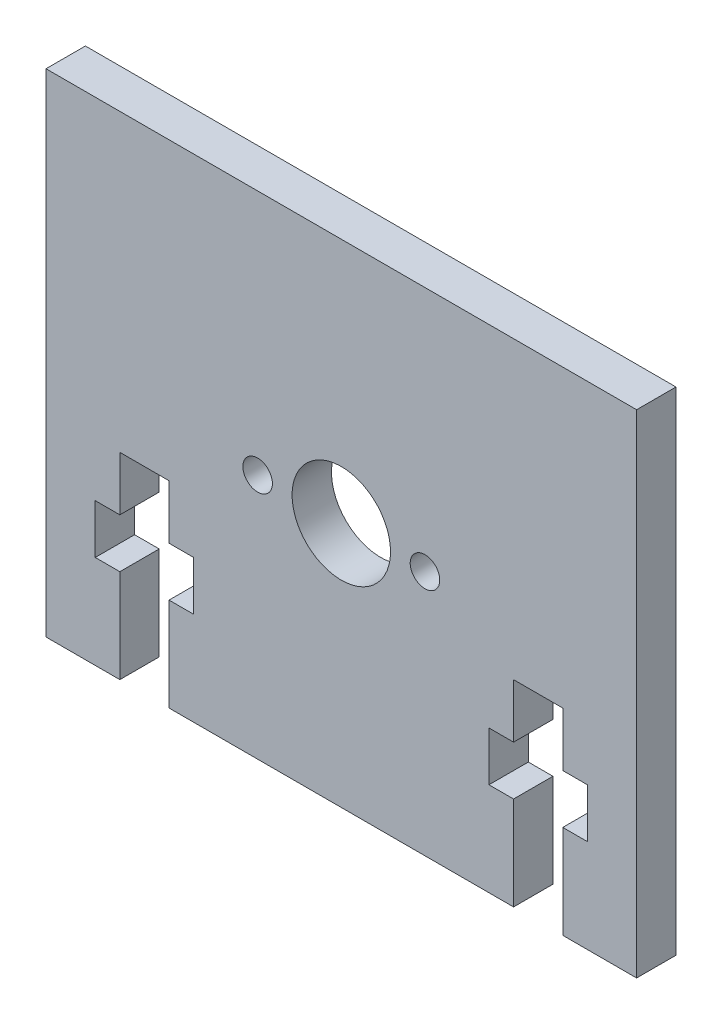
ISO-10303-21;
HEADER;
FILE_DESCRIPTION(('STEP AP214'),'2;1');
FILE_NAME('part.step','',(''),(''),'','','');
FILE_SCHEMA(('AUTOMOTIVE_DESIGN { 1 0 10303 214 1 1 1 1 }'));
ENDSEC;
DATA;
#1=APPLICATION_CONTEXT('core data for automotive mechanical design processes');
#2=APPLICATION_PROTOCOL_DEFINITION('international standard','automotive_design',2000,#1);
#3=PRODUCT_CONTEXT('',#1,'mechanical');
#4=PRODUCT('Part','Part','',(#3));
#5=PRODUCT_RELATED_PRODUCT_CATEGORY('part','',(#4));
#6=PRODUCT_DEFINITION_FORMATION('','',#4);
#7=PRODUCT_DEFINITION_CONTEXT('part definition',#1,'design');
#8=PRODUCT_DEFINITION('design','',#6,#7);
#9=PRODUCT_DEFINITION_SHAPE('','',#8);
#10=(LENGTH_UNIT() NAMED_UNIT(*) SI_UNIT(.MILLI.,.METRE.));
#11=(NAMED_UNIT(*) PLANE_ANGLE_UNIT() SI_UNIT($,.RADIAN.));
#12=(NAMED_UNIT(*) SI_UNIT($,.STERADIAN.) SOLID_ANGLE_UNIT());
#13=UNCERTAINTY_MEASURE_WITH_UNIT(LENGTH_MEASURE(1.E-05),#10,'distance_accuracy_value','');
#14=(GEOMETRIC_REPRESENTATION_CONTEXT(3) GLOBAL_UNCERTAINTY_ASSIGNED_CONTEXT((#13)) GLOBAL_UNIT_ASSIGNED_CONTEXT((#10,
#11,#12)) REPRESENTATION_CONTEXT('',''));
#15=CARTESIAN_POINT('',(0.,0.,0.));
#16=DIRECTION('',(0.,0.,1.));
#17=DIRECTION('',(1.,0.,0.));
#18=AXIS2_PLACEMENT_3D('',#15,#16,#17);
#19=CARTESIAN_POINT('',(30.,-25.,4.));
#20=DIRECTION('',(0.,1.,0.));
#21=DIRECTION('',(-1.,0.,0.));
#22=AXIS2_PLACEMENT_3D('',#19,#20,#21);
#23=PLANE('',#22);
#24=DIRECTION('',(1.,0.,0.));
#25=VECTOR('',#24,1.);
#26=CARTESIAN_POINT('',(30.,-25.,0.));
#27=LINE('',#26,#25);
#28=CARTESIAN_POINT('',(-17.5,-25.,0.));
#29=VERTEX_POINT('',#28);
#30=CARTESIAN_POINT('',(17.5,-25.,0.));
#31=VERTEX_POINT('',#30);
#32=EDGE_CURVE('E237',#29,#31,#27,.T.);
#33=ORIENTED_EDGE('',*,*,#32,.T.);
#34=DIRECTION('',(0.,0.,1.));
#35=VECTOR('',#34,1.);
#36=CARTESIAN_POINT('',(17.5,-25.,0.));
#37=LINE('',#36,#35);
#38=CARTESIAN_POINT('',(17.5,-25.,4.));
#39=VERTEX_POINT('',#38);
#40=EDGE_CURVE('E219',#31,#39,#37,.T.);
#41=ORIENTED_EDGE('',*,*,#40,.T.);
#42=DIRECTION('',(1.,0.,0.));
#43=VECTOR('',#42,1.);
#44=CARTESIAN_POINT('',(30.,-25.,4.));
#45=LINE('',#44,#43);
#46=CARTESIAN_POINT('',(-17.5,-25.,4.));
#47=VERTEX_POINT('',#46);
#48=EDGE_CURVE('E288',#47,#39,#45,.T.);
#49=ORIENTED_EDGE('',*,*,#48,.F.);
#50=DIRECTION('',(0.,0.,1.));
#51=VECTOR('',#50,1.);
#52=CARTESIAN_POINT('',(-17.5,-25.,0.));
#53=LINE('',#52,#51);
#54=EDGE_CURVE('E242',#29,#47,#53,.T.);
#55=ORIENTED_EDGE('',*,*,#54,.F.);
#56=EDGE_LOOP('',(#33,#41,#49,#55));
#57=FACE_BOUND('',#56,.T.);
#58=ADVANCED_FACE('F34',(#57),#23,.F.);
#59=CARTESIAN_POINT('',(-30.,-25.,0.));
#60=VERTEX_POINT('',#59);
#61=CARTESIAN_POINT('',(-22.5,-25.,0.));
#62=VERTEX_POINT('',#61);
#63=EDGE_CURVE('E243',#60,#62,#27,.T.);
#64=ORIENTED_EDGE('',*,*,#63,.T.);
#65=DIRECTION('',(0.,0.,1.));
#66=VECTOR('',#65,1.);
#67=CARTESIAN_POINT('',(-22.5,-25.,0.));
#68=LINE('',#67,#66);
#69=CARTESIAN_POINT('',(-22.5,-25.,4.));
#70=VERTEX_POINT('',#69);
#71=EDGE_CURVE('E340',#62,#70,#68,.T.);
#72=ORIENTED_EDGE('',*,*,#71,.T.);
#73=CARTESIAN_POINT('',(-30.,-25.,4.));
#74=VERTEX_POINT('',#73);
#75=EDGE_CURVE('E290',#74,#70,#45,.T.);
#76=ORIENTED_EDGE('',*,*,#75,.F.);
#77=DIRECTION('',(0.,0.,-1.));
#78=VECTOR('',#77,1.);
#79=CARTESIAN_POINT('',(-30.,-25.,4.));
#80=LINE('',#79,#78);
#81=EDGE_CURVE('E11',#74,#60,#80,.T.);
#82=ORIENTED_EDGE('',*,*,#81,.T.);
#83=EDGE_LOOP('',(#64,#72,#76,#82));
#84=FACE_BOUND('',#83,.T.);
#85=ADVANCED_FACE('F430',(#84),#23,.F.);
#86=CARTESIAN_POINT('',(0.,0.,4.));
#87=DIRECTION('',(0.,0.,-1.));
#88=DIRECTION('',(-1.,0.,0.));
#89=AXIS2_PLACEMENT_3D('',#86,#87,#88);
#90=PLANE('',#89);
#91=ORIENTED_EDGE('',*,*,#48,.T.);
#92=DIRECTION('',(0.,-1.,0.));
#93=VECTOR('',#92,1.);
#94=CARTESIAN_POINT('',(17.5,-15.5,4.));
#95=LINE('',#94,#93);
#96=CARTESIAN_POINT('',(17.5,-15.5,4.));
#97=VERTEX_POINT('',#96);
#98=EDGE_CURVE('E225',#97,#39,#95,.T.);
#99=ORIENTED_EDGE('',*,*,#98,.F.);
#100=DIRECTION('',(1.,0.,0.));
#101=VECTOR('',#100,1.);
#102=CARTESIAN_POINT('',(17.5,-15.5,4.));
#103=LINE('',#102,#101);
#104=CARTESIAN_POINT('',(15.,-15.5,4.));
#105=VERTEX_POINT('',#104);
#106=EDGE_CURVE('E240',#105,#97,#103,.T.);
#107=ORIENTED_EDGE('',*,*,#106,.F.);
#108=DIRECTION('',(0.,-1.,0.));
#109=VECTOR('',#108,1.);
#110=CARTESIAN_POINT('',(15.,-15.5,4.));
#111=LINE('',#110,#109);
#112=CARTESIAN_POINT('',(15.,-10.5,4.));
#113=VERTEX_POINT('',#112);
#114=EDGE_CURVE('E790',#113,#105,#111,.T.);
#115=ORIENTED_EDGE('',*,*,#114,.F.);
#116=DIRECTION('',(-1.,0.,0.));
#117=VECTOR('',#116,1.);
#118=CARTESIAN_POINT('',(17.5,-10.5,4.));
#119=LINE('',#118,#117);
#120=CARTESIAN_POINT('',(17.5,-10.5,4.));
#121=VERTEX_POINT('',#120);
#122=EDGE_CURVE('E816',#121,#113,#119,.T.);
#123=ORIENTED_EDGE('',*,*,#122,.F.);
#124=DIRECTION('',(0.,-1.,0.));
#125=VECTOR('',#124,1.);
#126=CARTESIAN_POINT('',(17.5,-4.99999999999995,4.));
#127=LINE('',#126,#125);
#128=CARTESIAN_POINT('',(17.5,-4.99999999999995,4.));
#129=VERTEX_POINT('',#128);
#130=EDGE_CURVE('E813',#129,#121,#127,.T.);
#131=ORIENTED_EDGE('',*,*,#130,.F.);
#132=DIRECTION('',(-1.,0.,0.));
#133=VECTOR('',#132,1.);
#134=CARTESIAN_POINT('',(22.5,-4.99999999999995,4.));
#135=LINE('',#134,#133);
#136=CARTESIAN_POINT('',(22.5,-4.99999999999995,4.));
#137=VERTEX_POINT('',#136);
#138=EDGE_CURVE('E810',#137,#129,#135,.T.);
#139=ORIENTED_EDGE('',*,*,#138,.F.);
#140=DIRECTION('',(0.,1.,0.));
#141=VECTOR('',#140,1.);
#142=CARTESIAN_POINT('',(22.5,-4.99999999999995,4.));
#143=LINE('',#142,#141);
#144=CARTESIAN_POINT('',(22.5,-10.5,4.));
#145=VERTEX_POINT('',#144);
#146=EDGE_CURVE('E807',#145,#137,#143,.T.);
#147=ORIENTED_EDGE('',*,*,#146,.F.);
#148=DIRECTION('',(-1.,0.,0.));
#149=VECTOR('',#148,1.);
#150=CARTESIAN_POINT('',(25.,-10.5,4.));
#151=LINE('',#150,#149);
#152=CARTESIAN_POINT('',(25.,-10.5,4.));
#153=VERTEX_POINT('',#152);
#154=EDGE_CURVE('E804',#153,#145,#151,.T.);
#155=ORIENTED_EDGE('',*,*,#154,.F.);
#156=DIRECTION('',(0.,1.,0.));
#157=VECTOR('',#156,1.);
#158=CARTESIAN_POINT('',(25.,-15.5,4.));
#159=LINE('',#158,#157);
#160=CARTESIAN_POINT('',(25.,-15.5,4.));
#161=VERTEX_POINT('',#160);
#162=EDGE_CURVE('E801',#161,#153,#159,.T.);
#163=ORIENTED_EDGE('',*,*,#162,.F.);
#164=DIRECTION('',(1.,0.,0.));
#165=VECTOR('',#164,1.);
#166=CARTESIAN_POINT('',(25.,-15.5,4.));
#167=LINE('',#166,#165);
#168=CARTESIAN_POINT('',(22.5,-15.5,4.));
#169=VERTEX_POINT('',#168);
#170=EDGE_CURVE('E794',#169,#161,#167,.T.);
#171=ORIENTED_EDGE('',*,*,#170,.F.);
#172=DIRECTION('',(0.,1.,0.));
#173=VECTOR('',#172,1.);
#174=CARTESIAN_POINT('',(22.5,-15.5,4.));
#175=LINE('',#174,#173);
#176=CARTESIAN_POINT('',(22.5,-25.,4.));
#177=VERTEX_POINT('',#176);
#178=EDGE_CURVE('E300',#177,#169,#175,.T.);
#179=ORIENTED_EDGE('',*,*,#178,.F.);
#180=CARTESIAN_POINT('',(30.,-25.,4.));
#181=VERTEX_POINT('',#180);
#182=EDGE_CURVE('E286',#177,#181,#45,.T.);
#183=ORIENTED_EDGE('',*,*,#182,.T.);
#184=DIRECTION('',(0.,1.,0.));
#185=VECTOR('',#184,1.);
#186=CARTESIAN_POINT('',(30.,25.,4.));
#187=LINE('',#186,#185);
#188=CARTESIAN_POINT('',(30.,25.,4.));
#189=VERTEX_POINT('',#188);
#190=EDGE_CURVE('E269',#181,#189,#187,.T.);
#191=ORIENTED_EDGE('',*,*,#190,.T.);
#192=DIRECTION('',(-1.,0.,0.));
#193=VECTOR('',#192,1.);
#194=CARTESIAN_POINT('',(30.,25.,4.));
#195=LINE('',#194,#193);
#196=CARTESIAN_POINT('',(-30.,25.,4.));
#197=VERTEX_POINT('',#196);
#198=EDGE_CURVE('E260',#189,#197,#195,.T.);
#199=ORIENTED_EDGE('',*,*,#198,.T.);
#200=DIRECTION('',(0.,-1.,0.));
#201=VECTOR('',#200,1.);
#202=CARTESIAN_POINT('',(-30.,25.,4.));
#203=LINE('',#202,#201);
#204=EDGE_CURVE('E255',#197,#74,#203,.T.);
#205=ORIENTED_EDGE('',*,*,#204,.T.);
#206=ORIENTED_EDGE('',*,*,#75,.T.);
#207=DIRECTION('',(0.,-1.,0.));
#208=VECTOR('',#207,1.);
#209=CARTESIAN_POINT('',(-22.5,-15.5,4.));
#210=LINE('',#209,#208);
#211=CARTESIAN_POINT('',(-22.5,-15.5,4.));
#212=VERTEX_POINT('',#211);
#213=EDGE_CURVE('E341',#212,#70,#210,.T.);
#214=ORIENTED_EDGE('',*,*,#213,.F.);
#215=DIRECTION('',(1.,0.,0.));
#216=VECTOR('',#215,1.);
#217=CARTESIAN_POINT('',(-22.5,-15.5,4.));
#218=LINE('',#217,#216);
#219=CARTESIAN_POINT('',(-25.,-15.5,4.));
#220=VERTEX_POINT('',#219);
#221=EDGE_CURVE('E311',#220,#212,#218,.T.);
#222=ORIENTED_EDGE('',*,*,#221,.F.);
#223=DIRECTION('',(0.,-1.,0.));
#224=VECTOR('',#223,1.);
#225=CARTESIAN_POINT('',(-25.,-10.5,4.));
#226=LINE('',#225,#224);
#227=CARTESIAN_POINT('',(-25.,-10.5,4.));
#228=VERTEX_POINT('',#227);
#229=EDGE_CURVE('E368',#228,#220,#226,.T.);
#230=ORIENTED_EDGE('',*,*,#229,.F.);
#231=DIRECTION('',(-1.,0.,0.));
#232=VECTOR('',#231,1.);
#233=CARTESIAN_POINT('',(-22.5,-10.5,4.));
#234=LINE('',#233,#232);
#235=CARTESIAN_POINT('',(-22.5,-10.5,4.));
#236=VERTEX_POINT('',#235);
#237=EDGE_CURVE('E365',#236,#228,#234,.T.);
#238=ORIENTED_EDGE('',*,*,#237,.F.);
#239=DIRECTION('',(0.,-1.,0.));
#240=VECTOR('',#239,1.);
#241=CARTESIAN_POINT('',(-22.5,-4.99999999999995,4.));
#242=LINE('',#241,#240);
#243=CARTESIAN_POINT('',(-22.5,-4.99999999999995,4.));
#244=VERTEX_POINT('',#243);
#245=EDGE_CURVE('E362',#244,#236,#242,.T.);
#246=ORIENTED_EDGE('',*,*,#245,.F.);
#247=DIRECTION('',(-1.,0.,0.));
#248=VECTOR('',#247,1.);
#249=CARTESIAN_POINT('',(-17.5,-4.99999999999995,4.));
#250=LINE('',#249,#248);
#251=CARTESIAN_POINT('',(-17.5,-4.99999999999995,4.));
#252=VERTEX_POINT('',#251);
#253=EDGE_CURVE('E359',#252,#244,#250,.T.);
#254=ORIENTED_EDGE('',*,*,#253,.F.);
#255=DIRECTION('',(0.,1.,0.));
#256=VECTOR('',#255,1.);
#257=CARTESIAN_POINT('',(-17.5,-4.99999999999995,4.));
#258=LINE('',#257,#256);
#259=CARTESIAN_POINT('',(-17.5,-10.5,4.));
#260=VERTEX_POINT('',#259);
#261=EDGE_CURVE('E356',#260,#252,#258,.T.);
#262=ORIENTED_EDGE('',*,*,#261,.F.);
#263=DIRECTION('',(-1.,0.,0.));
#264=VECTOR('',#263,1.);
#265=CARTESIAN_POINT('',(-15.,-10.5,4.));
#266=LINE('',#265,#264);
#267=CARTESIAN_POINT('',(-15.,-10.5,4.));
#268=VERTEX_POINT('',#267);
#269=EDGE_CURVE('E353',#268,#260,#266,.T.);
#270=ORIENTED_EDGE('',*,*,#269,.F.);
#271=DIRECTION('',(0.,1.,0.));
#272=VECTOR('',#271,1.);
#273=CARTESIAN_POINT('',(-15.,-10.5,4.));
#274=LINE('',#273,#272);
#275=CARTESIAN_POINT('',(-15.,-15.5,4.));
#276=VERTEX_POINT('',#275);
#277=EDGE_CURVE('E350',#276,#268,#274,.T.);
#278=ORIENTED_EDGE('',*,*,#277,.F.);
#279=DIRECTION('',(1.,0.,0.));
#280=VECTOR('',#279,1.);
#281=CARTESIAN_POINT('',(-15.,-15.5,4.));
#282=LINE('',#281,#280);
#283=CARTESIAN_POINT('',(-17.5,-15.5,4.));
#284=VERTEX_POINT('',#283);
#285=EDGE_CURVE('E347',#284,#276,#282,.T.);
#286=ORIENTED_EDGE('',*,*,#285,.F.);
#287=DIRECTION('',(0.,1.,0.));
#288=VECTOR('',#287,1.);
#289=CARTESIAN_POINT('',(-17.5,-15.5,4.));
#290=LINE('',#289,#288);
#291=EDGE_CURVE('E343',#47,#284,#290,.T.);
#292=ORIENTED_EDGE('',*,*,#291,.F.);
#293=EDGE_LOOP('',(#91,#99,#107,#115,#123,#131,#139,#147,#155,#163,#171,#179,#183,#191,#199,
#205,#206,#214,#222,#230,#238,#246,#254,#262,#270,#278,#286,#292));
#294=FACE_BOUND('',#293,.T.);
#295=CARTESIAN_POINT('',(0.,0.,4.));
#296=DIRECTION('',(0.,0.,1.));
#297=DIRECTION('',(1.,0.,0.));
#298=AXIS2_PLACEMENT_3D('',#295,#296,#297);
#299=CIRCLE('',#298,5.);
#300=CARTESIAN_POINT('',(5.,0.,4.));
#301=VERTEX_POINT('',#300);
#302=EDGE_CURVE('E407',#301,#301,#299,.T.);
#303=ORIENTED_EDGE('',*,*,#302,.F.);
#304=EDGE_LOOP('',(#303));
#305=FACE_BOUND('',#304,.T.);
#306=CARTESIAN_POINT('',(-8.5,0.,4.));
#307=DIRECTION('',(0.,0.,1.));
#308=DIRECTION('',(1.,0.,0.));
#309=AXIS2_PLACEMENT_3D('',#306,#307,#308);
#310=CIRCLE('',#309,1.5);
#311=CARTESIAN_POINT('',(-7.,0.,4.));
#312=VERTEX_POINT('',#311);
#313=EDGE_CURVE('E403',#312,#312,#310,.T.);
#314=ORIENTED_EDGE('',*,*,#313,.F.);
#315=EDGE_LOOP('',(#314));
#316=FACE_BOUND('',#315,.T.);
#317=CARTESIAN_POINT('',(8.5,0.,4.));
#318=DIRECTION('',(0.,0.,1.));
#319=DIRECTION('',(1.,0.,0.));
#320=AXIS2_PLACEMENT_3D('',#317,#318,#319);
#321=CIRCLE('',#320,1.5);
#322=CARTESIAN_POINT('',(10.,0.,4.));
#323=VERTEX_POINT('',#322);
#324=EDGE_CURVE('E397',#323,#323,#321,.T.);
#325=ORIENTED_EDGE('',*,*,#324,.F.);
#326=EDGE_LOOP('',(#325));
#327=FACE_BOUND('',#326,.T.);
#328=ADVANCED_FACE('F295',(#294,#305,#316,#327),#90,.F.);
#329=CARTESIAN_POINT('',(0.,0.,0.));
#330=DIRECTION('',(0.,0.,-1.));
#331=DIRECTION('',(-1.,0.,0.));
#332=AXIS2_PLACEMENT_3D('',#329,#330,#331);
#333=PLANE('',#332);
#334=DIRECTION('',(0.,-1.,0.));
#335=VECTOR('',#334,1.);
#336=CARTESIAN_POINT('',(17.5,-15.5,0.));
#337=LINE('',#336,#335);
#338=CARTESIAN_POINT('',(17.5,-15.5,0.));
#339=VERTEX_POINT('',#338);
#340=EDGE_CURVE('E222',#339,#31,#337,.T.);
#341=ORIENTED_EDGE('',*,*,#340,.T.);
#342=ORIENTED_EDGE('',*,*,#32,.F.);
#343=DIRECTION('',(0.,1.,0.));
#344=VECTOR('',#343,1.);
#345=CARTESIAN_POINT('',(-17.5,-15.5,0.));
#346=LINE('',#345,#344);
#347=CARTESIAN_POINT('',(-17.5,-15.5,0.));
#348=VERTEX_POINT('',#347);
#349=EDGE_CURVE('E57',#29,#348,#346,.T.);
#350=ORIENTED_EDGE('',*,*,#349,.T.);
#351=DIRECTION('',(1.,0.,0.));
#352=VECTOR('',#351,1.);
#353=CARTESIAN_POINT('',(-15.,-15.5,0.));
#354=LINE('',#353,#352);
#355=CARTESIAN_POINT('',(-15.,-15.5,0.));
#356=VERTEX_POINT('',#355);
#357=EDGE_CURVE('E313',#348,#356,#354,.T.);
#358=ORIENTED_EDGE('',*,*,#357,.T.);
#359=DIRECTION('',(0.,1.,0.));
#360=VECTOR('',#359,1.);
#361=CARTESIAN_POINT('',(-15.,-10.5,0.));
#362=LINE('',#361,#360);
#363=CARTESIAN_POINT('',(-15.,-10.5,0.));
#364=VERTEX_POINT('',#363);
#365=EDGE_CURVE('E316',#356,#364,#362,.T.);
#366=ORIENTED_EDGE('',*,*,#365,.T.);
#367=DIRECTION('',(-1.,0.,0.));
#368=VECTOR('',#367,1.);
#369=CARTESIAN_POINT('',(-15.,-10.5,0.));
#370=LINE('',#369,#368);
#371=CARTESIAN_POINT('',(-17.5,-10.5,0.));
#372=VERTEX_POINT('',#371);
#373=EDGE_CURVE('E319',#364,#372,#370,.T.);
#374=ORIENTED_EDGE('',*,*,#373,.T.);
#375=DIRECTION('',(0.,1.,0.));
#376=VECTOR('',#375,1.);
#377=CARTESIAN_POINT('',(-17.5,-4.99999999999995,0.));
#378=LINE('',#377,#376);
#379=CARTESIAN_POINT('',(-17.5,-4.99999999999995,0.));
#380=VERTEX_POINT('',#379);
#381=EDGE_CURVE('E322',#372,#380,#378,.T.);
#382=ORIENTED_EDGE('',*,*,#381,.T.);
#383=DIRECTION('',(-1.,0.,0.));
#384=VECTOR('',#383,1.);
#385=CARTESIAN_POINT('',(-17.5,-4.99999999999995,0.));
#386=LINE('',#385,#384);
#387=CARTESIAN_POINT('',(-22.5,-4.99999999999995,0.));
#388=VERTEX_POINT('',#387);
#389=EDGE_CURVE('E325',#380,#388,#386,.T.);
#390=ORIENTED_EDGE('',*,*,#389,.T.);
#391=DIRECTION('',(0.,-1.,0.));
#392=VECTOR('',#391,1.);
#393=CARTESIAN_POINT('',(-22.5,-4.99999999999995,0.));
#394=LINE('',#393,#392);
#395=CARTESIAN_POINT('',(-22.5,-10.5,0.));
#396=VERTEX_POINT('',#395);
#397=EDGE_CURVE('E328',#388,#396,#394,.T.);
#398=ORIENTED_EDGE('',*,*,#397,.T.);
#399=DIRECTION('',(-1.,0.,0.));
#400=VECTOR('',#399,1.);
#401=CARTESIAN_POINT('',(-22.5,-10.5,0.));
#402=LINE('',#401,#400);
#403=CARTESIAN_POINT('',(-25.,-10.5,0.));
#404=VERTEX_POINT('',#403);
#405=EDGE_CURVE('E331',#396,#404,#402,.T.);
#406=ORIENTED_EDGE('',*,*,#405,.T.);
#407=DIRECTION('',(0.,-1.,0.));
#408=VECTOR('',#407,1.);
#409=CARTESIAN_POINT('',(-25.,-10.5,0.));
#410=LINE('',#409,#408);
#411=CARTESIAN_POINT('',(-25.,-15.5,0.));
#412=VERTEX_POINT('',#411);
#413=EDGE_CURVE('E334',#404,#412,#410,.T.);
#414=ORIENTED_EDGE('',*,*,#413,.T.);
#415=DIRECTION('',(1.,0.,0.));
#416=VECTOR('',#415,1.);
#417=CARTESIAN_POINT('',(-22.5,-15.5,0.));
#418=LINE('',#417,#416);
#419=CARTESIAN_POINT('',(-22.5,-15.5,0.));
#420=VERTEX_POINT('',#419);
#421=EDGE_CURVE('E337',#412,#420,#418,.T.);
#422=ORIENTED_EDGE('',*,*,#421,.T.);
#423=DIRECTION('',(0.,-1.,0.));
#424=VECTOR('',#423,1.);
#425=CARTESIAN_POINT('',(-22.5,-15.5,0.));
#426=LINE('',#425,#424);
#427=EDGE_CURVE('E308',#420,#62,#426,.T.);
#428=ORIENTED_EDGE('',*,*,#427,.T.);
#429=ORIENTED_EDGE('',*,*,#63,.F.);
#430=DIRECTION('',(0.,-1.,0.));
#431=VECTOR('',#430,1.);
#432=CARTESIAN_POINT('',(-30.,25.,0.));
#433=LINE('',#432,#431);
#434=CARTESIAN_POINT('',(-30.,25.,0.));
#435=VERTEX_POINT('',#434);
#436=EDGE_CURVE('E248',#435,#60,#433,.T.);
#437=ORIENTED_EDGE('',*,*,#436,.F.);
#438=DIRECTION('',(-1.,0.,0.));
#439=VECTOR('',#438,1.);
#440=CARTESIAN_POINT('',(30.,25.,0.));
#441=LINE('',#440,#439);
#442=CARTESIAN_POINT('',(30.,25.,0.));
#443=VERTEX_POINT('',#442);
#444=EDGE_CURVE('E253',#443,#435,#441,.T.);
#445=ORIENTED_EDGE('',*,*,#444,.F.);
#446=DIRECTION('',(0.,1.,0.));
#447=VECTOR('',#446,1.);
#448=CARTESIAN_POINT('',(30.,25.,0.));
#449=LINE('',#448,#447);
#450=CARTESIAN_POINT('',(30.,-25.,0.));
#451=VERTEX_POINT('',#450);
#452=EDGE_CURVE('E247',#451,#443,#449,.T.);
#453=ORIENTED_EDGE('',*,*,#452,.F.);
#454=CARTESIAN_POINT('',(22.5,-25.,0.));
#455=VERTEX_POINT('',#454);
#456=EDGE_CURVE('E244',#455,#451,#27,.T.);
#457=ORIENTED_EDGE('',*,*,#456,.F.);
#458=DIRECTION('',(0.,1.,0.));
#459=VECTOR('',#458,1.);
#460=CARTESIAN_POINT('',(22.5,-15.5,0.));
#461=LINE('',#460,#459);
#462=CARTESIAN_POINT('',(22.5,-15.5,0.));
#463=VERTEX_POINT('',#462);
#464=EDGE_CURVE('E49',#455,#463,#461,.T.);
#465=ORIENTED_EDGE('',*,*,#464,.T.);
#466=DIRECTION('',(1.,0.,0.));
#467=VECTOR('',#466,1.);
#468=CARTESIAN_POINT('',(25.,-15.5,0.));
#469=LINE('',#468,#467);
#470=CARTESIAN_POINT('',(25.,-15.5,0.));
#471=VERTEX_POINT('',#470);
#472=EDGE_CURVE('E849',#463,#471,#469,.T.);
#473=ORIENTED_EDGE('',*,*,#472,.T.);
#474=DIRECTION('',(0.,1.,0.));
#475=VECTOR('',#474,1.);
#476=CARTESIAN_POINT('',(25.,-15.5,0.));
#477=LINE('',#476,#475);
#478=CARTESIAN_POINT('',(25.,-10.5,0.));
#479=VERTEX_POINT('',#478);
#480=EDGE_CURVE('E837',#471,#479,#477,.T.);
#481=ORIENTED_EDGE('',*,*,#480,.T.);
#482=DIRECTION('',(-1.,0.,0.));
#483=VECTOR('',#482,1.);
#484=CARTESIAN_POINT('',(25.,-10.5,0.));
#485=LINE('',#484,#483);
#486=CARTESIAN_POINT('',(22.5,-10.5,0.));
#487=VERTEX_POINT('',#486);
#488=EDGE_CURVE('E845',#479,#487,#485,.T.);
#489=ORIENTED_EDGE('',*,*,#488,.T.);
#490=DIRECTION('',(0.,1.,0.));
#491=VECTOR('',#490,1.);
#492=CARTESIAN_POINT('',(22.5,-4.99999999999995,0.));
#493=LINE('',#492,#491);
#494=CARTESIAN_POINT('',(22.5,-4.99999999999995,0.));
#495=VERTEX_POINT('',#494);
#496=EDGE_CURVE('E847',#487,#495,#493,.T.);
#497=ORIENTED_EDGE('',*,*,#496,.T.);
#498=DIRECTION('',(-1.,0.,0.));
#499=VECTOR('',#498,1.);
#500=CARTESIAN_POINT('',(22.5,-4.99999999999995,0.));
#501=LINE('',#500,#499);
#502=CARTESIAN_POINT('',(17.5,-4.99999999999995,0.));
#503=VERTEX_POINT('',#502);
#504=EDGE_CURVE('E855',#495,#503,#501,.T.);
#505=ORIENTED_EDGE('',*,*,#504,.T.);
#506=DIRECTION('',(0.,-1.,0.));
#507=VECTOR('',#506,1.);
#508=CARTESIAN_POINT('',(17.5,-4.99999999999995,0.));
#509=LINE('',#508,#507);
#510=CARTESIAN_POINT('',(17.5,-10.5,0.));
#511=VERTEX_POINT('',#510);
#512=EDGE_CURVE('E858',#503,#511,#509,.T.);
#513=ORIENTED_EDGE('',*,*,#512,.T.);
#514=DIRECTION('',(-1.,0.,0.));
#515=VECTOR('',#514,1.);
#516=CARTESIAN_POINT('',(17.5,-10.5,0.));
#517=LINE('',#516,#515);
#518=CARTESIAN_POINT('',(15.,-10.5,0.));
#519=VERTEX_POINT('',#518);
#520=EDGE_CURVE('E861',#511,#519,#517,.T.);
#521=ORIENTED_EDGE('',*,*,#520,.T.);
#522=DIRECTION('',(0.,-1.,0.));
#523=VECTOR('',#522,1.);
#524=CARTESIAN_POINT('',(15.,-15.5,0.));
#525=LINE('',#524,#523);
#526=CARTESIAN_POINT('',(15.,-15.5,0.));
#527=VERTEX_POINT('',#526);
#528=EDGE_CURVE('E863',#519,#527,#525,.T.);
#529=ORIENTED_EDGE('',*,*,#528,.T.);
#530=DIRECTION('',(1.,0.,0.));
#531=VECTOR('',#530,1.);
#532=CARTESIAN_POINT('',(17.5,-15.5,0.));
#533=LINE('',#532,#531);
#534=EDGE_CURVE('E231',#527,#339,#533,.T.);
#535=ORIENTED_EDGE('',*,*,#534,.T.);
#536=EDGE_LOOP('',(#341,#342,#350,#358,#366,#374,#382,#390,#398,#406,#414,#422,#428,#429,#437,
#445,#453,#457,#465,#473,#481,#489,#497,#505,#513,#521,#529,#535));
#537=FACE_BOUND('',#536,.T.);
#538=CARTESIAN_POINT('',(-8.5,0.,0.));
#539=DIRECTION('',(0.,0.,1.));
#540=DIRECTION('',(1.,0.,0.));
#541=AXIS2_PLACEMENT_3D('',#538,#539,#540);
#542=CIRCLE('',#541,1.5);
#543=CARTESIAN_POINT('',(-7.,0.,0.));
#544=VERTEX_POINT('',#543);
#545=EDGE_CURVE('E400',#544,#544,#542,.T.);
#546=ORIENTED_EDGE('',*,*,#545,.T.);
#547=EDGE_LOOP('',(#546));
#548=FACE_BOUND('',#547,.T.);
#549=CARTESIAN_POINT('',(0.,0.,0.));
#550=DIRECTION('',(0.,0.,1.));
#551=DIRECTION('',(1.,0.,0.));
#552=AXIS2_PLACEMENT_3D('',#549,#550,#551);
#553=CIRCLE('',#552,5.);
#554=CARTESIAN_POINT('',(5.,0.,0.));
#555=VERTEX_POINT('',#554);
#556=EDGE_CURVE('E292',#555,#555,#553,.T.);
#557=ORIENTED_EDGE('',*,*,#556,.T.);
#558=EDGE_LOOP('',(#557));
#559=FACE_BOUND('',#558,.T.);
#560=CARTESIAN_POINT('',(8.5,0.,0.));
#561=DIRECTION('',(0.,0.,1.));
#562=DIRECTION('',(1.,0.,0.));
#563=AXIS2_PLACEMENT_3D('',#560,#561,#562);
#564=CIRCLE('',#563,1.5);
#565=CARTESIAN_POINT('',(10.,0.,0.));
#566=VERTEX_POINT('',#565);
#567=EDGE_CURVE('E375',#566,#566,#564,.T.);
#568=ORIENTED_EDGE('',*,*,#567,.T.);
#569=EDGE_LOOP('',(#568));
#570=FACE_BOUND('',#569,.T.);
#571=ADVANCED_FACE('F235',(#537,#548,#559,#570),#333,.T.);
#572=CARTESIAN_POINT('',(-30.,25.,4.));
#573=DIRECTION('',(1.,0.,0.));
#574=DIRECTION('',(0.,1.,0.));
#575=AXIS2_PLACEMENT_3D('',#572,#573,#574);
#576=PLANE('',#575);
#577=ORIENTED_EDGE('',*,*,#436,.T.);
#578=ORIENTED_EDGE('',*,*,#81,.F.);
#579=ORIENTED_EDGE('',*,*,#204,.F.);
#580=DIRECTION('',(0.,0.,-1.));
#581=VECTOR('',#580,1.);
#582=CARTESIAN_POINT('',(-30.,25.,4.));
#583=LINE('',#582,#581);
#584=EDGE_CURVE('E256',#197,#435,#583,.T.);
#585=ORIENTED_EDGE('',*,*,#584,.T.);
#586=EDGE_LOOP('',(#577,#578,#579,#585));
#587=FACE_BOUND('',#586,.T.);
#588=ADVANCED_FACE('F36',(#587),#576,.F.);
#589=ORIENTED_EDGE('',*,*,#182,.F.);
#590=DIRECTION('',(0.,0.,1.));
#591=VECTOR('',#590,1.);
#592=CARTESIAN_POINT('',(22.5,-25.,0.));
#593=LINE('',#592,#591);
#594=EDGE_CURVE('E230',#455,#177,#593,.T.);
#595=ORIENTED_EDGE('',*,*,#594,.F.);
#596=ORIENTED_EDGE('',*,*,#456,.T.);
#597=DIRECTION('',(0.,0.,-1.));
#598=VECTOR('',#597,1.);
#599=CARTESIAN_POINT('',(30.,-25.,4.));
#600=LINE('',#599,#598);
#601=EDGE_CURVE('E42',#181,#451,#600,.T.);
#602=ORIENTED_EDGE('',*,*,#601,.F.);
#603=EDGE_LOOP('',(#589,#595,#596,#602));
#604=FACE_BOUND('',#603,.T.);
#605=ADVANCED_FACE('F301',(#604),#23,.F.);
#606=CARTESIAN_POINT('',(30.,25.,4.));
#607=DIRECTION('',(-1.,0.,0.));
#608=DIRECTION('',(0.,-1.,0.));
#609=AXIS2_PLACEMENT_3D('',#606,#607,#608);
#610=PLANE('',#609);
#611=ORIENTED_EDGE('',*,*,#452,.T.);
#612=DIRECTION('',(0.,0.,-1.));
#613=VECTOR('',#612,1.);
#614=CARTESIAN_POINT('',(30.,25.,4.));
#615=LINE('',#614,#613);
#616=EDGE_CURVE('E259',#189,#443,#615,.T.);
#617=ORIENTED_EDGE('',*,*,#616,.F.);
#618=ORIENTED_EDGE('',*,*,#190,.F.);
#619=ORIENTED_EDGE('',*,*,#601,.T.);
#620=EDGE_LOOP('',(#611,#617,#618,#619));
#621=FACE_BOUND('',#620,.T.);
#622=ADVANCED_FACE('F267',(#621),#610,.F.);
#623=CARTESIAN_POINT('',(30.,25.,4.));
#624=DIRECTION('',(0.,-1.,0.));
#625=DIRECTION('',(0.,0.,-1.));
#626=AXIS2_PLACEMENT_3D('',#623,#624,#625);
#627=PLANE('',#626);
#628=ORIENTED_EDGE('',*,*,#444,.T.);
#629=ORIENTED_EDGE('',*,*,#584,.F.);
#630=ORIENTED_EDGE('',*,*,#198,.F.);
#631=ORIENTED_EDGE('',*,*,#616,.T.);
#632=EDGE_LOOP('',(#628,#629,#630,#631));
#633=FACE_BOUND('',#632,.T.);
#634=ADVANCED_FACE('F278',(#633),#627,.F.);
#635=CARTESIAN_POINT('',(0.,0.,4.));
#636=DIRECTION('',(0.,0.,-1.));
#637=DIRECTION('',(-1.,0.,0.));
#638=AXIS2_PLACEMENT_3D('',#635,#636,#637);
#639=CYLINDRICAL_SURFACE('',#638,5.);
#640=ORIENTED_EDGE('',*,*,#302,.T.);
#641=EDGE_LOOP('',(#640));
#642=FACE_BOUND('',#641,.T.);
#643=ORIENTED_EDGE('',*,*,#556,.F.);
#644=EDGE_LOOP('',(#643));
#645=FACE_BOUND('',#644,.T.);
#646=ADVANCED_FACE('F416',(#642,#645),#639,.F.);
#647=CARTESIAN_POINT('',(-8.5,0.,4.));
#648=DIRECTION('',(0.,0.,-1.));
#649=DIRECTION('',(-1.,0.,0.));
#650=AXIS2_PLACEMENT_3D('',#647,#648,#649);
#651=CYLINDRICAL_SURFACE('',#650,1.5);
#652=ORIENTED_EDGE('',*,*,#313,.T.);
#653=EDGE_LOOP('',(#652));
#654=FACE_BOUND('',#653,.T.);
#655=ORIENTED_EDGE('',*,*,#545,.F.);
#656=EDGE_LOOP('',(#655));
#657=FACE_BOUND('',#656,.T.);
#658=ADVANCED_FACE('F418',(#654,#657),#651,.F.);
#659=CARTESIAN_POINT('',(8.5,0.,4.));
#660=DIRECTION('',(0.,0.,-1.));
#661=DIRECTION('',(-1.,0.,0.));
#662=AXIS2_PLACEMENT_3D('',#659,#660,#661);
#663=CYLINDRICAL_SURFACE('',#662,1.5);
#664=ORIENTED_EDGE('',*,*,#324,.T.);
#665=EDGE_LOOP('',(#664));
#666=FACE_BOUND('',#665,.T.);
#667=ORIENTED_EDGE('',*,*,#567,.F.);
#668=EDGE_LOOP('',(#667));
#669=FACE_BOUND('',#668,.T.);
#670=ADVANCED_FACE('F424',(#666,#669),#663,.F.);
#671=CARTESIAN_POINT('',(-22.5,-15.5,0.));
#672=DIRECTION('',(-1.,0.,0.));
#673=DIRECTION('',(0.,0.,1.));
#674=AXIS2_PLACEMENT_3D('',#671,#672,#673);
#675=PLANE('',#674);
#676=ORIENTED_EDGE('',*,*,#213,.T.);
#677=ORIENTED_EDGE('',*,*,#71,.F.);
#678=ORIENTED_EDGE('',*,*,#427,.F.);
#679=DIRECTION('',(0.,0.,1.));
#680=VECTOR('',#679,1.);
#681=CARTESIAN_POINT('',(-22.5,-15.5,0.));
#682=LINE('',#681,#680);
#683=EDGE_CURVE('E373',#420,#212,#682,.T.);
#684=ORIENTED_EDGE('',*,*,#683,.T.);
#685=EDGE_LOOP('',(#676,#677,#678,#684));
#686=FACE_BOUND('',#685,.T.);
#687=ADVANCED_FACE('F466',(#686),#675,.F.);
#688=CARTESIAN_POINT('',(-22.5,-15.5,0.));
#689=DIRECTION('',(0.,-1.,0.));
#690=DIRECTION('',(0.,0.,-1.));
#691=AXIS2_PLACEMENT_3D('',#688,#689,#690);
#692=PLANE('',#691);
#693=ORIENTED_EDGE('',*,*,#221,.T.);
#694=ORIENTED_EDGE('',*,*,#683,.F.);
#695=ORIENTED_EDGE('',*,*,#421,.F.);
#696=DIRECTION('',(0.,0.,1.));
#697=VECTOR('',#696,1.);
#698=CARTESIAN_POINT('',(-25.,-15.5,0.));
#699=LINE('',#698,#697);
#700=EDGE_CURVE('E376',#412,#220,#699,.T.);
#701=ORIENTED_EDGE('',*,*,#700,.T.);
#702=EDGE_LOOP('',(#693,#694,#695,#701));
#703=FACE_BOUND('',#702,.T.);
#704=ADVANCED_FACE('F471',(#703),#692,.F.);
#705=CARTESIAN_POINT('',(-25.,-10.5,0.));
#706=DIRECTION('',(-1.,0.,0.));
#707=DIRECTION('',(0.,0.,1.));
#708=AXIS2_PLACEMENT_3D('',#705,#706,#707);
#709=PLANE('',#708);
#710=ORIENTED_EDGE('',*,*,#229,.T.);
#711=ORIENTED_EDGE('',*,*,#700,.F.);
#712=ORIENTED_EDGE('',*,*,#413,.F.);
#713=DIRECTION('',(0.,0.,1.));
#714=VECTOR('',#713,1.);
#715=CARTESIAN_POINT('',(-25.,-10.5,0.));
#716=LINE('',#715,#714);
#717=EDGE_CURVE('E378',#404,#228,#716,.T.);
#718=ORIENTED_EDGE('',*,*,#717,.T.);
#719=EDGE_LOOP('',(#710,#711,#712,#718));
#720=FACE_BOUND('',#719,.T.);
#721=ADVANCED_FACE('F533',(#720),#709,.F.);
#722=CARTESIAN_POINT('',(-22.5,-10.5,0.));
#723=DIRECTION('',(0.,1.,0.));
#724=DIRECTION('',(-1.,0.,0.));
#725=AXIS2_PLACEMENT_3D('',#722,#723,#724);
#726=PLANE('',#725);
#727=ORIENTED_EDGE('',*,*,#237,.T.);
#728=ORIENTED_EDGE('',*,*,#717,.F.);
#729=ORIENTED_EDGE('',*,*,#405,.F.);
#730=DIRECTION('',(0.,0.,1.));
#731=VECTOR('',#730,1.);
#732=CARTESIAN_POINT('',(-22.5,-10.5,0.));
#733=LINE('',#732,#731);
#734=EDGE_CURVE('E380',#396,#236,#733,.T.);
#735=ORIENTED_EDGE('',*,*,#734,.T.);
#736=EDGE_LOOP('',(#727,#728,#729,#735));
#737=FACE_BOUND('',#736,.T.);
#738=ADVANCED_FACE('F523',(#737),#726,.F.);
#739=CARTESIAN_POINT('',(-22.5,-4.99999999999995,0.));
#740=DIRECTION('',(-1.,0.,0.));
#741=DIRECTION('',(0.,0.,1.));
#742=AXIS2_PLACEMENT_3D('',#739,#740,#741);
#743=PLANE('',#742);
#744=ORIENTED_EDGE('',*,*,#245,.T.);
#745=ORIENTED_EDGE('',*,*,#734,.F.);
#746=ORIENTED_EDGE('',*,*,#397,.F.);
#747=DIRECTION('',(0.,0.,1.));
#748=VECTOR('',#747,1.);
#749=CARTESIAN_POINT('',(-22.5,-4.99999999999995,0.));
#750=LINE('',#749,#748);
#751=EDGE_CURVE('E382',#388,#244,#750,.T.);
#752=ORIENTED_EDGE('',*,*,#751,.T.);
#753=EDGE_LOOP('',(#744,#745,#746,#752));
#754=FACE_BOUND('',#753,.T.);
#755=ADVANCED_FACE('F513',(#754),#743,.F.);
#756=CARTESIAN_POINT('',(-17.5,-4.99999999999995,0.));
#757=DIRECTION('',(0.,1.,0.));
#758=DIRECTION('',(-1.,0.,0.));
#759=AXIS2_PLACEMENT_3D('',#756,#757,#758);
#760=PLANE('',#759);
#761=ORIENTED_EDGE('',*,*,#253,.T.);
#762=ORIENTED_EDGE('',*,*,#751,.F.);
#763=ORIENTED_EDGE('',*,*,#389,.F.);
#764=DIRECTION('',(0.,0.,1.));
#765=VECTOR('',#764,1.);
#766=CARTESIAN_POINT('',(-17.5,-4.99999999999995,0.));
#767=LINE('',#766,#765);
#768=EDGE_CURVE('E384',#380,#252,#767,.T.);
#769=ORIENTED_EDGE('',*,*,#768,.T.);
#770=EDGE_LOOP('',(#761,#762,#763,#769));
#771=FACE_BOUND('',#770,.T.);
#772=ADVANCED_FACE('F501',(#771),#760,.F.);
#773=CARTESIAN_POINT('',(-17.5,-4.99999999999995,0.));
#774=DIRECTION('',(1.,0.,0.));
#775=DIRECTION('',(0.,0.,-1.));
#776=AXIS2_PLACEMENT_3D('',#773,#774,#775);
#777=PLANE('',#776);
#778=ORIENTED_EDGE('',*,*,#261,.T.);
#779=ORIENTED_EDGE('',*,*,#768,.F.);
#780=ORIENTED_EDGE('',*,*,#381,.F.);
#781=DIRECTION('',(0.,0.,1.));
#782=VECTOR('',#781,1.);
#783=CARTESIAN_POINT('',(-17.5,-10.5,0.));
#784=LINE('',#783,#782);
#785=EDGE_CURVE('E386',#372,#260,#784,.T.);
#786=ORIENTED_EDGE('',*,*,#785,.T.);
#787=EDGE_LOOP('',(#778,#779,#780,#786));
#788=FACE_BOUND('',#787,.T.);
#789=ADVANCED_FACE('F495',(#788),#777,.F.);
#790=CARTESIAN_POINT('',(-15.,-10.5,0.));
#791=DIRECTION('',(0.,1.,0.));
#792=DIRECTION('',(0.,0.,1.));
#793=AXIS2_PLACEMENT_3D('',#790,#791,#792);
#794=PLANE('',#793);
#795=ORIENTED_EDGE('',*,*,#269,.T.);
#796=ORIENTED_EDGE('',*,*,#785,.F.);
#797=ORIENTED_EDGE('',*,*,#373,.F.);
#798=DIRECTION('',(0.,0.,1.));
#799=VECTOR('',#798,1.);
#800=CARTESIAN_POINT('',(-15.,-10.5,0.));
#801=LINE('',#800,#799);
#802=EDGE_CURVE('E388',#364,#268,#801,.T.);
#803=ORIENTED_EDGE('',*,*,#802,.T.);
#804=EDGE_LOOP('',(#795,#796,#797,#803));
#805=FACE_BOUND('',#804,.T.);
#806=ADVANCED_FACE('F500',(#805),#794,.F.);
#807=CARTESIAN_POINT('',(-15.,-10.5,0.));
#808=DIRECTION('',(1.,0.,0.));
#809=DIRECTION('',(0.,1.,0.));
#810=AXIS2_PLACEMENT_3D('',#807,#808,#809);
#811=PLANE('',#810);
#812=ORIENTED_EDGE('',*,*,#277,.T.);
#813=ORIENTED_EDGE('',*,*,#802,.F.);
#814=ORIENTED_EDGE('',*,*,#365,.F.);
#815=DIRECTION('',(0.,0.,1.));
#816=VECTOR('',#815,1.);
#817=CARTESIAN_POINT('',(-15.,-15.5,0.));
#818=LINE('',#817,#816);
#819=EDGE_CURVE('E390',#356,#276,#818,.T.);
#820=ORIENTED_EDGE('',*,*,#819,.T.);
#821=EDGE_LOOP('',(#812,#813,#814,#820));
#822=FACE_BOUND('',#821,.T.);
#823=ADVANCED_FACE('F557',(#822),#811,.F.);
#824=CARTESIAN_POINT('',(-15.,-15.5,0.));
#825=DIRECTION('',(0.,-1.,0.));
#826=DIRECTION('',(0.,0.,-1.));
#827=AXIS2_PLACEMENT_3D('',#824,#825,#826);
#828=PLANE('',#827);
#829=ORIENTED_EDGE('',*,*,#285,.T.);
#830=ORIENTED_EDGE('',*,*,#819,.F.);
#831=ORIENTED_EDGE('',*,*,#357,.F.);
#832=DIRECTION('',(0.,0.,1.));
#833=VECTOR('',#832,1.);
#834=CARTESIAN_POINT('',(-17.5,-15.5,0.));
#835=LINE('',#834,#833);
#836=EDGE_CURVE('E392',#348,#284,#835,.T.);
#837=ORIENTED_EDGE('',*,*,#836,.T.);
#838=EDGE_LOOP('',(#829,#830,#831,#837));
#839=FACE_BOUND('',#838,.T.);
#840=ADVANCED_FACE('F486',(#839),#828,.F.);
#841=CARTESIAN_POINT('',(-17.5,-15.5,0.));
#842=DIRECTION('',(1.,0.,0.));
#843=DIRECTION('',(0.,0.,-1.));
#844=AXIS2_PLACEMENT_3D('',#841,#842,#843);
#845=PLANE('',#844);
#846=ORIENTED_EDGE('',*,*,#291,.T.);
#847=ORIENTED_EDGE('',*,*,#836,.F.);
#848=ORIENTED_EDGE('',*,*,#349,.F.);
#849=ORIENTED_EDGE('',*,*,#54,.T.);
#850=EDGE_LOOP('',(#846,#847,#848,#849));
#851=FACE_BOUND('',#850,.T.);
#852=ADVANCED_FACE('F481',(#851),#845,.F.);
#853=CARTESIAN_POINT('',(17.5,-15.5,0.));
#854=DIRECTION('',(-1.,0.,0.));
#855=DIRECTION('',(0.,-1.,0.));
#856=AXIS2_PLACEMENT_3D('',#853,#854,#855);
#857=PLANE('',#856);
#858=ORIENTED_EDGE('',*,*,#98,.T.);
#859=ORIENTED_EDGE('',*,*,#40,.F.);
#860=ORIENTED_EDGE('',*,*,#340,.F.);
#861=DIRECTION('',(0.,0.,1.));
#862=VECTOR('',#861,1.);
#863=CARTESIAN_POINT('',(17.5,-15.5,0.));
#864=LINE('',#863,#862);
#865=EDGE_CURVE('E344',#339,#97,#864,.T.);
#866=ORIENTED_EDGE('',*,*,#865,.T.);
#867=EDGE_LOOP('',(#858,#859,#860,#866));
#868=FACE_BOUND('',#867,.T.);
#869=ADVANCED_FACE('F221',(#868),#857,.F.);
#870=CARTESIAN_POINT('',(17.5,-15.5,0.));
#871=DIRECTION('',(0.,-1.,0.));
#872=DIRECTION('',(0.,0.,-1.));
#873=AXIS2_PLACEMENT_3D('',#870,#871,#872);
#874=PLANE('',#873);
#875=ORIENTED_EDGE('',*,*,#106,.T.);
#876=ORIENTED_EDGE('',*,*,#865,.F.);
#877=ORIENTED_EDGE('',*,*,#534,.F.);
#878=DIRECTION('',(0.,0.,1.));
#879=VECTOR('',#878,1.);
#880=CARTESIAN_POINT('',(15.,-15.5,0.));
#881=LINE('',#880,#879);
#882=EDGE_CURVE('E787',#527,#105,#881,.T.);
#883=ORIENTED_EDGE('',*,*,#882,.T.);
#884=EDGE_LOOP('',(#875,#876,#877,#883));
#885=FACE_BOUND('',#884,.T.);
#886=ADVANCED_FACE('F682',(#885),#874,.F.);
#887=CARTESIAN_POINT('',(15.,-15.5,0.));
#888=DIRECTION('',(-1.,0.,0.));
#889=DIRECTION('',(0.,0.,1.));
#890=AXIS2_PLACEMENT_3D('',#887,#888,#889);
#891=PLANE('',#890);
#892=ORIENTED_EDGE('',*,*,#114,.T.);
#893=ORIENTED_EDGE('',*,*,#882,.F.);
#894=ORIENTED_EDGE('',*,*,#528,.F.);
#895=DIRECTION('',(0.,0.,1.));
#896=VECTOR('',#895,1.);
#897=CARTESIAN_POINT('',(15.,-10.5,0.));
#898=LINE('',#897,#896);
#899=EDGE_CURVE('E822',#519,#113,#898,.T.);
#900=ORIENTED_EDGE('',*,*,#899,.T.);
#901=EDGE_LOOP('',(#892,#893,#894,#900));
#902=FACE_BOUND('',#901,.T.);
#903=ADVANCED_FACE('F672',(#902),#891,.F.);
#904=CARTESIAN_POINT('',(17.5,-10.5,0.));
#905=DIRECTION('',(0.,1.,0.));
#906=DIRECTION('',(0.,0.,1.));
#907=AXIS2_PLACEMENT_3D('',#904,#905,#906);
#908=PLANE('',#907);
#909=ORIENTED_EDGE('',*,*,#122,.T.);
#910=ORIENTED_EDGE('',*,*,#899,.F.);
#911=ORIENTED_EDGE('',*,*,#520,.F.);
#912=DIRECTION('',(0.,0.,1.));
#913=VECTOR('',#912,1.);
#914=CARTESIAN_POINT('',(17.5,-10.5,0.));
#915=LINE('',#914,#913);
#916=EDGE_CURVE('E824',#511,#121,#915,.T.);
#917=ORIENTED_EDGE('',*,*,#916,.T.);
#918=EDGE_LOOP('',(#909,#910,#911,#917));
#919=FACE_BOUND('',#918,.T.);
#920=ADVANCED_FACE('F662',(#919),#908,.F.);
#921=CARTESIAN_POINT('',(17.5,-4.99999999999995,0.));
#922=DIRECTION('',(-1.,0.,0.));
#923=DIRECTION('',(0.,0.,1.));
#924=AXIS2_PLACEMENT_3D('',#921,#922,#923);
#925=PLANE('',#924);
#926=ORIENTED_EDGE('',*,*,#130,.T.);
#927=ORIENTED_EDGE('',*,*,#916,.F.);
#928=ORIENTED_EDGE('',*,*,#512,.F.);
#929=DIRECTION('',(0.,0.,1.));
#930=VECTOR('',#929,1.);
#931=CARTESIAN_POINT('',(17.5,-4.99999999999995,0.));
#932=LINE('',#931,#930);
#933=EDGE_CURVE('E826',#503,#129,#932,.T.);
#934=ORIENTED_EDGE('',*,*,#933,.T.);
#935=EDGE_LOOP('',(#926,#927,#928,#934));
#936=FACE_BOUND('',#935,.T.);
#937=ADVANCED_FACE('F652',(#936),#925,.F.);
#938=CARTESIAN_POINT('',(22.5,-4.99999999999995,0.));
#939=DIRECTION('',(0.,1.,0.));
#940=DIRECTION('',(0.,0.,1.));
#941=AXIS2_PLACEMENT_3D('',#938,#939,#940);
#942=PLANE('',#941);
#943=ORIENTED_EDGE('',*,*,#138,.T.);
#944=ORIENTED_EDGE('',*,*,#933,.F.);
#945=ORIENTED_EDGE('',*,*,#504,.F.);
#946=DIRECTION('',(0.,0.,1.));
#947=VECTOR('',#946,1.);
#948=CARTESIAN_POINT('',(22.5,-4.99999999999995,0.));
#949=LINE('',#948,#947);
#950=EDGE_CURVE('E828',#495,#137,#949,.T.);
#951=ORIENTED_EDGE('',*,*,#950,.T.);
#952=EDGE_LOOP('',(#943,#944,#945,#951));
#953=FACE_BOUND('',#952,.T.);
#954=ADVANCED_FACE('F628',(#953),#942,.F.);
#955=CARTESIAN_POINT('',(22.5,-4.99999999999995,0.));
#956=DIRECTION('',(1.,0.,0.));
#957=DIRECTION('',(0.,0.,-1.));
#958=AXIS2_PLACEMENT_3D('',#955,#956,#957);
#959=PLANE('',#958);
#960=ORIENTED_EDGE('',*,*,#146,.T.);
#961=ORIENTED_EDGE('',*,*,#950,.F.);
#962=ORIENTED_EDGE('',*,*,#496,.F.);
#963=DIRECTION('',(0.,0.,1.));
#964=VECTOR('',#963,1.);
#965=CARTESIAN_POINT('',(22.5,-10.5,0.));
#966=LINE('',#965,#964);
#967=EDGE_CURVE('E830',#487,#145,#966,.T.);
#968=ORIENTED_EDGE('',*,*,#967,.T.);
#969=EDGE_LOOP('',(#960,#961,#962,#968));
#970=FACE_BOUND('',#969,.T.);
#971=ADVANCED_FACE('F623',(#970),#959,.F.);
#972=CARTESIAN_POINT('',(25.,-10.5,0.));
#973=DIRECTION('',(0.,1.,0.));
#974=DIRECTION('',(0.,0.,1.));
#975=AXIS2_PLACEMENT_3D('',#972,#973,#974);
#976=PLANE('',#975);
#977=ORIENTED_EDGE('',*,*,#154,.T.);
#978=ORIENTED_EDGE('',*,*,#967,.F.);
#979=ORIENTED_EDGE('',*,*,#488,.F.);
#980=DIRECTION('',(0.,0.,1.));
#981=VECTOR('',#980,1.);
#982=CARTESIAN_POINT('',(25.,-10.5,0.));
#983=LINE('',#982,#981);
#984=EDGE_CURVE('E832',#479,#153,#983,.T.);
#985=ORIENTED_EDGE('',*,*,#984,.T.);
#986=EDGE_LOOP('',(#977,#978,#979,#985));
#987=FACE_BOUND('',#986,.T.);
#988=ADVANCED_FACE('F615',(#987),#976,.F.);
#989=CARTESIAN_POINT('',(25.,-15.5,0.));
#990=DIRECTION('',(1.,0.,0.));
#991=DIRECTION('',(0.,0.,-1.));
#992=AXIS2_PLACEMENT_3D('',#989,#990,#991);
#993=PLANE('',#992);
#994=ORIENTED_EDGE('',*,*,#162,.T.);
#995=ORIENTED_EDGE('',*,*,#984,.F.);
#996=ORIENTED_EDGE('',*,*,#480,.F.);
#997=DIRECTION('',(0.,0.,1.));
#998=VECTOR('',#997,1.);
#999=CARTESIAN_POINT('',(25.,-15.5,0.));
#1000=LINE('',#999,#998);
#1001=EDGE_CURVE('E304',#471,#161,#1000,.T.);
#1002=ORIENTED_EDGE('',*,*,#1001,.T.);
#1003=EDGE_LOOP('',(#994,#995,#996,#1002));
#1004=FACE_BOUND('',#1003,.T.);
#1005=ADVANCED_FACE('F610',(#1004),#993,.F.);
#1006=CARTESIAN_POINT('',(25.,-15.5,0.));
#1007=DIRECTION('',(0.,-1.,0.));
#1008=DIRECTION('',(0.,0.,-1.));
#1009=AXIS2_PLACEMENT_3D('',#1006,#1007,#1008);
#1010=PLANE('',#1009);
#1011=ORIENTED_EDGE('',*,*,#170,.T.);
#1012=ORIENTED_EDGE('',*,*,#1001,.F.);
#1013=ORIENTED_EDGE('',*,*,#472,.F.);
#1014=DIRECTION('',(0.,0.,1.));
#1015=VECTOR('',#1014,1.);
#1016=CARTESIAN_POINT('',(22.5,-15.5,0.));
#1017=LINE('',#1016,#1015);
#1018=EDGE_CURVE('E302',#463,#169,#1017,.T.);
#1019=ORIENTED_EDGE('',*,*,#1018,.T.);
#1020=EDGE_LOOP('',(#1011,#1012,#1013,#1019));
#1021=FACE_BOUND('',#1020,.T.);
#1022=ADVANCED_FACE('F603',(#1021),#1010,.F.);
#1023=CARTESIAN_POINT('',(22.5,-15.5,0.));
#1024=DIRECTION('',(1.,0.,0.));
#1025=DIRECTION('',(0.,1.,0.));
#1026=AXIS2_PLACEMENT_3D('',#1023,#1024,#1025);
#1027=PLANE('',#1026);
#1028=ORIENTED_EDGE('',*,*,#178,.T.);
#1029=ORIENTED_EDGE('',*,*,#1018,.F.);
#1030=ORIENTED_EDGE('',*,*,#464,.F.);
#1031=ORIENTED_EDGE('',*,*,#594,.T.);
#1032=EDGE_LOOP('',(#1028,#1029,#1030,#1031));
#1033=FACE_BOUND('',#1032,.T.);
#1034=ADVANCED_FACE('F598',(#1033),#1027,.F.);
#1035=CLOSED_SHELL('',(#58,#85,#328,#571,#588,#605,#622,#634,#646,#658,#670,#687,#704,#721,#738,
#755,#772,#789,#806,#823,#840,#852,#869,#886,#903,#920,#937,#954,#971,#988,#1005,#1022,#1034));
#1036=MANIFOLD_SOLID_BREP('B2',#1035);
#1037=ADVANCED_BREP_SHAPE_REPRESENTATION('',(#18,#1036),#14);
#1038=SHAPE_DEFINITION_REPRESENTATION(#9,#1037);
ENDSEC;
END-ISO-10303-21;
